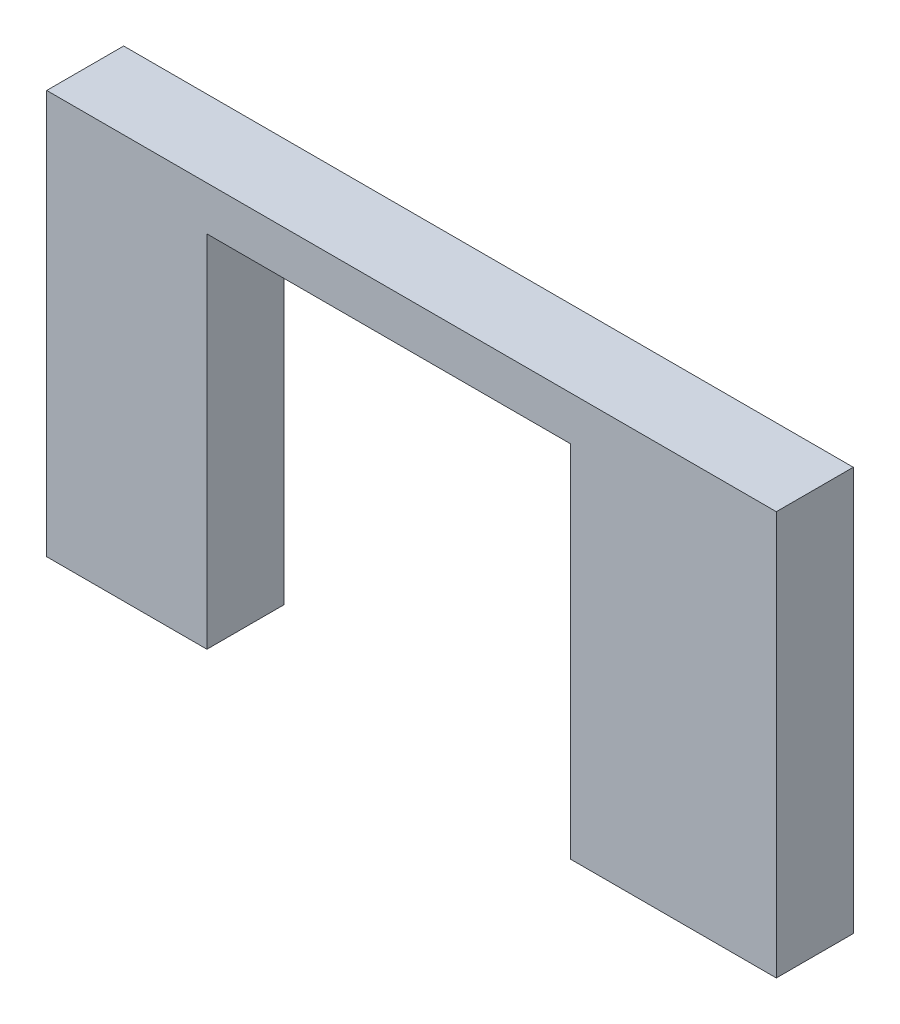
ISO-10303-21;
HEADER;
FILE_DESCRIPTION(('STEP AP214'),'2;1');
FILE_NAME('part.step','',(''),(''),'','','');
FILE_SCHEMA(('AUTOMOTIVE_DESIGN { 1 0 10303 214 1 1 1 1 }'));
ENDSEC;
DATA;
#1=APPLICATION_CONTEXT('core data for automotive mechanical design processes');
#2=APPLICATION_PROTOCOL_DEFINITION('international standard','automotive_design',2000,#1);
#3=PRODUCT_CONTEXT('',#1,'mechanical');
#4=PRODUCT('Part','Part','',(#3));
#5=PRODUCT_RELATED_PRODUCT_CATEGORY('part','',(#4));
#6=PRODUCT_DEFINITION_FORMATION('','',#4);
#7=PRODUCT_DEFINITION_CONTEXT('part definition',#1,'design');
#8=PRODUCT_DEFINITION('design','',#6,#7);
#9=PRODUCT_DEFINITION_SHAPE('','',#8);
#10=(LENGTH_UNIT() NAMED_UNIT(*) SI_UNIT(.MILLI.,.METRE.));
#11=(NAMED_UNIT(*) PLANE_ANGLE_UNIT() SI_UNIT($,.RADIAN.));
#12=(NAMED_UNIT(*) SI_UNIT($,.STERADIAN.) SOLID_ANGLE_UNIT());
#13=UNCERTAINTY_MEASURE_WITH_UNIT(LENGTH_MEASURE(1.E-05),#10,'distance_accuracy_value','');
#14=(GEOMETRIC_REPRESENTATION_CONTEXT(3) GLOBAL_UNCERTAINTY_ASSIGNED_CONTEXT((#13)) GLOBAL_UNIT_ASSIGNED_CONTEXT((#10,
#11,#12)) REPRESENTATION_CONTEXT('',''));
#15=CARTESIAN_POINT('',(0.,0.,0.));
#16=DIRECTION('',(0.,0.,1.));
#17=DIRECTION('',(1.,0.,0.));
#18=AXIS2_PLACEMENT_3D('',#15,#16,#17);
#19=CARTESIAN_POINT('',(0.,0.,3.175));
#20=DIRECTION('',(0.,1.,0.));
#21=DIRECTION('',(0.,0.,1.));
#22=AXIS2_PLACEMENT_3D('',#19,#20,#21);
#23=PLANE('',#22);
#24=DIRECTION('',(1.,0.,0.));
#25=VECTOR('',#24,1.);
#26=CARTESIAN_POINT('',(0.,0.,0.));
#27=LINE('',#26,#25);
#28=CARTESIAN_POINT('',(0.,0.,0.));
#29=VERTEX_POINT('',#28);
#30=CARTESIAN_POINT('',(6.61,0.,0.));
#31=VERTEX_POINT('',#30);
#32=EDGE_CURVE('E157',#29,#31,#27,.T.);
#33=ORIENTED_EDGE('',*,*,#32,.T.);
#34=DIRECTION('',(0.,0.,1.));
#35=VECTOR('',#34,1.);
#36=CARTESIAN_POINT('',(6.61,0.,3.175));
#37=LINE('',#36,#35);
#38=CARTESIAN_POINT('',(6.61,0.,3.175));
#39=VERTEX_POINT('',#38);
#40=EDGE_CURVE('E127',#31,#39,#37,.T.);
#41=ORIENTED_EDGE('',*,*,#40,.T.);
#42=DIRECTION('',(1.,0.,0.));
#43=VECTOR('',#42,1.);
#44=CARTESIAN_POINT('',(0.,0.,3.175));
#45=LINE('',#44,#43);
#46=CARTESIAN_POINT('',(0.,0.,3.175));
#47=VERTEX_POINT('',#46);
#48=EDGE_CURVE('E93',#47,#39,#45,.T.);
#49=ORIENTED_EDGE('',*,*,#48,.F.);
#50=DIRECTION('',(0.,0.,-1.));
#51=VECTOR('',#50,1.);
#52=CARTESIAN_POINT('',(0.,0.,3.175));
#53=LINE('',#52,#51);
#54=EDGE_CURVE('E48',#47,#29,#53,.T.);
#55=ORIENTED_EDGE('',*,*,#54,.T.);
#56=EDGE_LOOP('',(#33,#41,#49,#55));
#57=FACE_BOUND('',#56,.T.);
#58=ADVANCED_FACE('F40',(#57),#23,.F.);
#59=CARTESIAN_POINT('',(0.,0.,3.175));
#60=DIRECTION('',(1.,0.,0.));
#61=DIRECTION('',(0.,0.,-1.));
#62=AXIS2_PLACEMENT_3D('',#59,#60,#61);
#63=PLANE('',#62);
#64=DIRECTION('',(0.,-1.,0.));
#65=VECTOR('',#64,1.);
#66=CARTESIAN_POINT('',(0.,0.,0.));
#67=LINE('',#66,#65);
#68=CARTESIAN_POINT('',(0.,16.66,0.));
#69=VERTEX_POINT('',#68);
#70=EDGE_CURVE('E145',#69,#29,#67,.T.);
#71=ORIENTED_EDGE('',*,*,#70,.T.);
#72=ORIENTED_EDGE('',*,*,#54,.F.);
#73=DIRECTION('',(0.,-1.,0.));
#74=VECTOR('',#73,1.);
#75=CARTESIAN_POINT('',(0.,0.,3.175));
#76=LINE('',#75,#74);
#77=CARTESIAN_POINT('',(0.,16.66,3.175));
#78=VERTEX_POINT('',#77);
#79=EDGE_CURVE('E146',#78,#47,#76,.T.);
#80=ORIENTED_EDGE('',*,*,#79,.F.);
#81=DIRECTION('',(0.,0.,-1.));
#82=VECTOR('',#81,1.);
#83=CARTESIAN_POINT('',(0.,16.66,3.175));
#84=LINE('',#83,#82);
#85=EDGE_CURVE('E153',#78,#69,#84,.T.);
#86=ORIENTED_EDGE('',*,*,#85,.T.);
#87=EDGE_LOOP('',(#71,#72,#80,#86));
#88=FACE_BOUND('',#87,.T.);
#89=ADVANCED_FACE('F42',(#88),#63,.F.);
#90=CARTESIAN_POINT('',(21.61,0.,3.175));
#91=VERTEX_POINT('',#90);
#92=CARTESIAN_POINT('',(30.1,0.,3.175));
#93=VERTEX_POINT('',#92);
#94=EDGE_CURVE('E148',#91,#93,#45,.T.);
#95=ORIENTED_EDGE('',*,*,#94,.F.);
#96=DIRECTION('',(0.,0.,-1.));
#97=VECTOR('',#96,1.);
#98=CARTESIAN_POINT('',(21.61,0.,3.175));
#99=LINE('',#98,#97);
#100=CARTESIAN_POINT('',(21.61,0.,0.));
#101=VERTEX_POINT('',#100);
#102=EDGE_CURVE('E121',#91,#101,#99,.T.);
#103=ORIENTED_EDGE('',*,*,#102,.T.);
#104=CARTESIAN_POINT('',(30.1,0.,0.));
#105=VERTEX_POINT('',#104);
#106=EDGE_CURVE('E156',#101,#105,#27,.T.);
#107=ORIENTED_EDGE('',*,*,#106,.T.);
#108=DIRECTION('',(0.,0.,-1.));
#109=VECTOR('',#108,1.);
#110=CARTESIAN_POINT('',(30.1,0.,3.175));
#111=LINE('',#110,#109);
#112=EDGE_CURVE('E165',#93,#105,#111,.T.);
#113=ORIENTED_EDGE('',*,*,#112,.F.);
#114=EDGE_LOOP('',(#95,#103,#107,#113));
#115=FACE_BOUND('',#114,.T.);
#116=ADVANCED_FACE('F183',(#115),#23,.F.);
#117=CARTESIAN_POINT('',(30.1,0.,3.175));
#118=DIRECTION('',(-1.,0.,0.));
#119=DIRECTION('',(0.,0.,1.));
#120=AXIS2_PLACEMENT_3D('',#117,#118,#119);
#121=PLANE('',#120);
#122=DIRECTION('',(0.,1.,0.));
#123=VECTOR('',#122,1.);
#124=CARTESIAN_POINT('',(30.1,0.,0.));
#125=LINE('',#124,#123);
#126=CARTESIAN_POINT('',(30.1,16.66,0.));
#127=VERTEX_POINT('',#126);
#128=EDGE_CURVE('E159',#105,#127,#125,.T.);
#129=ORIENTED_EDGE('',*,*,#128,.T.);
#130=DIRECTION('',(0.,0.,-1.));
#131=VECTOR('',#130,1.);
#132=CARTESIAN_POINT('',(30.1,16.66,3.175));
#133=LINE('',#132,#131);
#134=CARTESIAN_POINT('',(30.1,16.66,3.175));
#135=VERTEX_POINT('',#134);
#136=EDGE_CURVE('E163',#135,#127,#133,.T.);
#137=ORIENTED_EDGE('',*,*,#136,.F.);
#138=DIRECTION('',(0.,1.,0.));
#139=VECTOR('',#138,1.);
#140=CARTESIAN_POINT('',(30.1,0.,3.175));
#141=LINE('',#140,#139);
#142=EDGE_CURVE('E150',#93,#135,#141,.T.);
#143=ORIENTED_EDGE('',*,*,#142,.F.);
#144=ORIENTED_EDGE('',*,*,#112,.T.);
#145=EDGE_LOOP('',(#129,#137,#143,#144));
#146=FACE_BOUND('',#145,.T.);
#147=ADVANCED_FACE('F174',(#146),#121,.F.);
#148=CARTESIAN_POINT('',(0.,16.66,3.175));
#149=DIRECTION('',(0.,-1.,0.));
#150=DIRECTION('',(0.,0.,-1.));
#151=AXIS2_PLACEMENT_3D('',#148,#149,#150);
#152=PLANE('',#151);
#153=DIRECTION('',(-1.,0.,0.));
#154=VECTOR('',#153,1.);
#155=CARTESIAN_POINT('',(0.,16.66,0.));
#156=LINE('',#155,#154);
#157=EDGE_CURVE('E85',#127,#69,#156,.T.);
#158=ORIENTED_EDGE('',*,*,#157,.T.);
#159=ORIENTED_EDGE('',*,*,#85,.F.);
#160=DIRECTION('',(-1.,0.,0.));
#161=VECTOR('',#160,1.);
#162=CARTESIAN_POINT('',(0.,16.66,3.175));
#163=LINE('',#162,#161);
#164=EDGE_CURVE('E64',#135,#78,#163,.T.);
#165=ORIENTED_EDGE('',*,*,#164,.F.);
#166=ORIENTED_EDGE('',*,*,#136,.T.);
#167=EDGE_LOOP('',(#158,#159,#165,#166));
#168=FACE_BOUND('',#167,.T.);
#169=ADVANCED_FACE('F177',(#168),#152,.F.);
#170=CARTESIAN_POINT('',(0.,0.,3.175));
#171=DIRECTION('',(0.,0.,-1.));
#172=DIRECTION('',(-1.,0.,0.));
#173=AXIS2_PLACEMENT_3D('',#170,#171,#172);
#174=PLANE('',#173);
#175=ORIENTED_EDGE('',*,*,#48,.T.);
#176=DIRECTION('',(0.,-1.,0.));
#177=VECTOR('',#176,1.);
#178=CARTESIAN_POINT('',(6.61,14.84,3.175));
#179=LINE('',#178,#177);
#180=CARTESIAN_POINT('',(6.61,14.84,3.175));
#181=VERTEX_POINT('',#180);
#182=EDGE_CURVE('E137',#181,#39,#179,.T.);
#183=ORIENTED_EDGE('',*,*,#182,.F.);
#184=DIRECTION('',(-1.,0.,0.));
#185=VECTOR('',#184,1.);
#186=CARTESIAN_POINT('',(6.61,14.84,3.175));
#187=LINE('',#186,#185);
#188=CARTESIAN_POINT('',(21.61,14.84,3.175));
#189=VERTEX_POINT('',#188);
#190=EDGE_CURVE('E118',#189,#181,#187,.T.);
#191=ORIENTED_EDGE('',*,*,#190,.F.);
#192=DIRECTION('',(0.,1.,0.));
#193=VECTOR('',#192,1.);
#194=CARTESIAN_POINT('',(21.61,14.84,3.175));
#195=LINE('',#194,#193);
#196=EDGE_CURVE('E139',#91,#189,#195,.T.);
#197=ORIENTED_EDGE('',*,*,#196,.F.);
#198=ORIENTED_EDGE('',*,*,#94,.T.);
#199=ORIENTED_EDGE('',*,*,#142,.T.);
#200=ORIENTED_EDGE('',*,*,#164,.T.);
#201=ORIENTED_EDGE('',*,*,#79,.T.);
#202=EDGE_LOOP('',(#175,#183,#191,#197,#198,#199,#200,#201));
#203=FACE_BOUND('',#202,.T.);
#204=ADVANCED_FACE('F178',(#203),#174,.F.);
#205=CARTESIAN_POINT('',(0.,0.,0.));
#206=DIRECTION('',(0.,0.,-1.));
#207=DIRECTION('',(-1.,0.,0.));
#208=AXIS2_PLACEMENT_3D('',#205,#206,#207);
#209=PLANE('',#208);
#210=DIRECTION('',(0.,-1.,0.));
#211=VECTOR('',#210,1.);
#212=CARTESIAN_POINT('',(6.61,14.84,0.));
#213=LINE('',#212,#211);
#214=CARTESIAN_POINT('',(6.61,14.84,0.));
#215=VERTEX_POINT('',#214);
#216=EDGE_CURVE('E125',#215,#31,#213,.T.);
#217=ORIENTED_EDGE('',*,*,#216,.T.);
#218=ORIENTED_EDGE('',*,*,#32,.F.);
#219=ORIENTED_EDGE('',*,*,#70,.F.);
#220=ORIENTED_EDGE('',*,*,#157,.F.);
#221=ORIENTED_EDGE('',*,*,#128,.F.);
#222=ORIENTED_EDGE('',*,*,#106,.F.);
#223=DIRECTION('',(0.,-1.,0.));
#224=VECTOR('',#223,1.);
#225=CARTESIAN_POINT('',(21.61,0.,0.));
#226=LINE('',#225,#224);
#227=CARTESIAN_POINT('',(21.61,14.84,0.));
#228=VERTEX_POINT('',#227);
#229=EDGE_CURVE('E11',#228,#101,#226,.T.);
#230=ORIENTED_EDGE('',*,*,#229,.F.);
#231=DIRECTION('',(-1.,0.,0.));
#232=VECTOR('',#231,1.);
#233=CARTESIAN_POINT('',(6.61,14.84,0.));
#234=LINE('',#233,#232);
#235=EDGE_CURVE('E55',#228,#215,#234,.T.);
#236=ORIENTED_EDGE('',*,*,#235,.T.);
#237=EDGE_LOOP('',(#217,#218,#219,#220,#221,#222,#230,#236));
#238=FACE_BOUND('',#237,.T.);
#239=ADVANCED_FACE('F132',(#238),#209,.T.);
#240=CARTESIAN_POINT('',(6.61,14.84,0.));
#241=DIRECTION('',(-1.,0.,0.));
#242=DIRECTION('',(0.,-1.,0.));
#243=AXIS2_PLACEMENT_3D('',#240,#241,#242);
#244=PLANE('',#243);
#245=ORIENTED_EDGE('',*,*,#216,.F.);
#246=DIRECTION('',(0.,0.,1.));
#247=VECTOR('',#246,1.);
#248=CARTESIAN_POINT('',(6.61,14.84,0.));
#249=LINE('',#248,#247);
#250=EDGE_CURVE('E114',#215,#181,#249,.T.);
#251=ORIENTED_EDGE('',*,*,#250,.T.);
#252=ORIENTED_EDGE('',*,*,#182,.T.);
#253=ORIENTED_EDGE('',*,*,#40,.F.);
#254=EDGE_LOOP('',(#245,#251,#252,#253));
#255=FACE_BOUND('',#254,.T.);
#256=ADVANCED_FACE('F126',(#255),#244,.F.);
#257=CARTESIAN_POINT('',(21.61,14.84,0.));
#258=DIRECTION('',(1.,0.,0.));
#259=DIRECTION('',(0.,1.,0.));
#260=AXIS2_PLACEMENT_3D('',#257,#258,#259);
#261=PLANE('',#260);
#262=ORIENTED_EDGE('',*,*,#196,.T.);
#263=DIRECTION('',(0.,0.,1.));
#264=VECTOR('',#263,1.);
#265=CARTESIAN_POINT('',(21.61,14.84,0.));
#266=LINE('',#265,#264);
#267=EDGE_CURVE('E122',#228,#189,#266,.T.);
#268=ORIENTED_EDGE('',*,*,#267,.F.);
#269=ORIENTED_EDGE('',*,*,#229,.T.);
#270=ORIENTED_EDGE('',*,*,#102,.F.);
#271=EDGE_LOOP('',(#262,#268,#269,#270));
#272=FACE_BOUND('',#271,.T.);
#273=ADVANCED_FACE('F184',(#272),#261,.F.);
#274=CARTESIAN_POINT('',(6.61,14.84,0.));
#275=DIRECTION('',(0.,1.,0.));
#276=DIRECTION('',(0.,0.,1.));
#277=AXIS2_PLACEMENT_3D('',#274,#275,#276);
#278=PLANE('',#277);
#279=ORIENTED_EDGE('',*,*,#190,.T.);
#280=ORIENTED_EDGE('',*,*,#250,.F.);
#281=ORIENTED_EDGE('',*,*,#235,.F.);
#282=ORIENTED_EDGE('',*,*,#267,.T.);
#283=EDGE_LOOP('',(#279,#280,#281,#282));
#284=FACE_BOUND('',#283,.T.);
#285=ADVANCED_FACE('F116',(#284),#278,.F.);
#286=CLOSED_SHELL('',(#58,#89,#116,#147,#169,#204,#239,#256,#273,#285));
#287=MANIFOLD_SOLID_BREP('B2',#286);
#288=ADVANCED_BREP_SHAPE_REPRESENTATION('',(#18,#287),#14);
#289=SHAPE_DEFINITION_REPRESENTATION(#9,#288);
ENDSEC;
END-ISO-10303-21;
